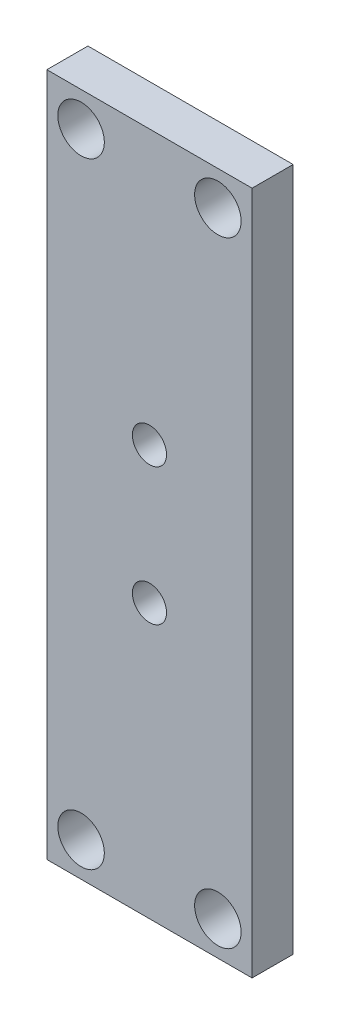
ISO-10303-21;
HEADER;
FILE_DESCRIPTION(('STEP AP214'),'2;1');
FILE_NAME('part.step','',(''),(''),'','','');
FILE_SCHEMA(('AUTOMOTIVE_DESIGN { 1 0 10303 214 1 1 1 1 }'));
ENDSEC;
DATA;
#1=APPLICATION_CONTEXT('core data for automotive mechanical design processes');
#2=APPLICATION_PROTOCOL_DEFINITION('international standard','automotive_design',2000,#1);
#3=PRODUCT_CONTEXT('',#1,'mechanical');
#4=PRODUCT('Part','Part','',(#3));
#5=PRODUCT_RELATED_PRODUCT_CATEGORY('part','',(#4));
#6=PRODUCT_DEFINITION_FORMATION('','',#4);
#7=PRODUCT_DEFINITION_CONTEXT('part definition',#1,'design');
#8=PRODUCT_DEFINITION('design','',#6,#7);
#9=PRODUCT_DEFINITION_SHAPE('','',#8);
#10=(LENGTH_UNIT() NAMED_UNIT(*) SI_UNIT(.MILLI.,.METRE.));
#11=(NAMED_UNIT(*) PLANE_ANGLE_UNIT() SI_UNIT($,.RADIAN.));
#12=(NAMED_UNIT(*) SI_UNIT($,.STERADIAN.) SOLID_ANGLE_UNIT());
#13=UNCERTAINTY_MEASURE_WITH_UNIT(LENGTH_MEASURE(1.E-05),#10,'distance_accuracy_value','');
#14=(GEOMETRIC_REPRESENTATION_CONTEXT(3) GLOBAL_UNCERTAINTY_ASSIGNED_CONTEXT((#13)) GLOBAL_UNIT_ASSIGNED_CONTEXT((#10,
#11,#12)) REPRESENTATION_CONTEXT('',''));
#15=CARTESIAN_POINT('',(0.,0.,0.));
#16=DIRECTION('',(0.,0.,1.));
#17=DIRECTION('',(1.,0.,0.));
#18=AXIS2_PLACEMENT_3D('',#15,#16,#17);
#19=CARTESIAN_POINT('',(7.49999999999999,25.,-3.));
#20=DIRECTION('',(-1.,0.,0.));
#21=DIRECTION('',(0.,-1.,0.));
#22=AXIS2_PLACEMENT_3D('',#19,#20,#21);
#23=PLANE('',#22);
#24=DIRECTION('',(0.,1.,0.));
#25=VECTOR('',#24,1.);
#26=CARTESIAN_POINT('',(7.49999999999999,25.,0.));
#27=LINE('',#26,#25);
#28=CARTESIAN_POINT('',(7.5,-25.,0.));
#29=VERTEX_POINT('',#28);
#30=CARTESIAN_POINT('',(7.49999999999999,25.,0.));
#31=VERTEX_POINT('',#30);
#32=EDGE_CURVE('E105',#29,#31,#27,.T.);
#33=ORIENTED_EDGE('',*,*,#32,.F.);
#34=DIRECTION('',(0.,0.,1.));
#35=VECTOR('',#34,1.);
#36=CARTESIAN_POINT('',(7.5,-25.,-3.));
#37=LINE('',#36,#35);
#38=CARTESIAN_POINT('',(7.5,-25.,-3.));
#39=VERTEX_POINT('',#38);
#40=EDGE_CURVE('E104',#39,#29,#37,.T.);
#41=ORIENTED_EDGE('',*,*,#40,.F.);
#42=DIRECTION('',(0.,1.,0.));
#43=VECTOR('',#42,1.);
#44=CARTESIAN_POINT('',(7.49999999999999,25.,-3.));
#45=LINE('',#44,#43);
#46=CARTESIAN_POINT('',(7.49999999999999,25.,-3.));
#47=VERTEX_POINT('',#46);
#48=EDGE_CURVE('E98',#39,#47,#45,.T.);
#49=ORIENTED_EDGE('',*,*,#48,.T.);
#50=DIRECTION('',(0.,0.,1.));
#51=VECTOR('',#50,1.);
#52=CARTESIAN_POINT('',(7.49999999999999,25.,-3.));
#53=LINE('',#52,#51);
#54=EDGE_CURVE('E11',#47,#31,#53,.T.);
#55=ORIENTED_EDGE('',*,*,#54,.T.);
#56=EDGE_LOOP('',(#33,#41,#49,#55));
#57=FACE_BOUND('',#56,.T.);
#58=ADVANCED_FACE('F41',(#57),#23,.F.);
#59=CARTESIAN_POINT('',(-7.50000000000001,25.,-3.));
#60=DIRECTION('',(0.,-1.,0.));
#61=DIRECTION('',(0.,0.,1.));
#62=AXIS2_PLACEMENT_3D('',#59,#60,#61);
#63=PLANE('',#62);
#64=DIRECTION('',(-1.,0.,0.));
#65=VECTOR('',#64,1.);
#66=CARTESIAN_POINT('',(-7.50000000000001,25.,0.));
#67=LINE('',#66,#65);
#68=CARTESIAN_POINT('',(-7.50000000000001,25.,0.));
#69=VERTEX_POINT('',#68);
#70=EDGE_CURVE('E107',#31,#69,#67,.T.);
#71=ORIENTED_EDGE('',*,*,#70,.F.);
#72=ORIENTED_EDGE('',*,*,#54,.F.);
#73=DIRECTION('',(-1.,0.,0.));
#74=VECTOR('',#73,1.);
#75=CARTESIAN_POINT('',(-7.50000000000001,25.,-3.));
#76=LINE('',#75,#74);
#77=CARTESIAN_POINT('',(-7.50000000000001,25.,-3.));
#78=VERTEX_POINT('',#77);
#79=EDGE_CURVE('E82',#47,#78,#76,.T.);
#80=ORIENTED_EDGE('',*,*,#79,.T.);
#81=DIRECTION('',(0.,0.,1.));
#82=VECTOR('',#81,1.);
#83=CARTESIAN_POINT('',(-7.50000000000001,25.,-3.));
#84=LINE('',#83,#82);
#85=EDGE_CURVE('E49',#78,#69,#84,.T.);
#86=ORIENTED_EDGE('',*,*,#85,.T.);
#87=EDGE_LOOP('',(#71,#72,#80,#86));
#88=FACE_BOUND('',#87,.T.);
#89=ADVANCED_FACE('F96',(#88),#63,.F.);
#90=CARTESIAN_POINT('',(-7.50000000000001,25.,-3.));
#91=DIRECTION('',(1.,0.,0.));
#92=DIRECTION('',(0.,1.,0.));
#93=AXIS2_PLACEMENT_3D('',#90,#91,#92);
#94=PLANE('',#93);
#95=DIRECTION('',(0.,-1.,0.));
#96=VECTOR('',#95,1.);
#97=CARTESIAN_POINT('',(-7.50000000000001,25.,0.));
#98=LINE('',#97,#96);
#99=CARTESIAN_POINT('',(-7.5,-25.,0.));
#100=VERTEX_POINT('',#99);
#101=EDGE_CURVE('E92',#69,#100,#98,.T.);
#102=ORIENTED_EDGE('',*,*,#101,.F.);
#103=ORIENTED_EDGE('',*,*,#85,.F.);
#104=DIRECTION('',(0.,-1.,0.));
#105=VECTOR('',#104,1.);
#106=CARTESIAN_POINT('',(-7.50000000000001,25.,-3.));
#107=LINE('',#106,#105);
#108=CARTESIAN_POINT('',(-7.5,-25.,-3.));
#109=VERTEX_POINT('',#108);
#110=EDGE_CURVE('E85',#78,#109,#107,.T.);
#111=ORIENTED_EDGE('',*,*,#110,.T.);
#112=DIRECTION('',(0.,0.,1.));
#113=VECTOR('',#112,1.);
#114=CARTESIAN_POINT('',(-7.5,-25.,-3.));
#115=LINE('',#114,#113);
#116=EDGE_CURVE('E95',#109,#100,#115,.T.);
#117=ORIENTED_EDGE('',*,*,#116,.T.);
#118=EDGE_LOOP('',(#102,#103,#111,#117));
#119=FACE_BOUND('',#118,.T.);
#120=ADVANCED_FACE('F91',(#119),#94,.F.);
#121=CARTESIAN_POINT('',(-7.5,-25.,-3.));
#122=DIRECTION('',(0.,1.,0.));
#123=DIRECTION('',(0.,0.,-1.));
#124=AXIS2_PLACEMENT_3D('',#121,#122,#123);
#125=PLANE('',#124);
#126=DIRECTION('',(1.,0.,0.));
#127=VECTOR('',#126,1.);
#128=CARTESIAN_POINT('',(-7.5,-25.,0.));
#129=LINE('',#128,#127);
#130=EDGE_CURVE('E71',#100,#29,#129,.T.);
#131=ORIENTED_EDGE('',*,*,#130,.F.);
#132=ORIENTED_EDGE('',*,*,#116,.F.);
#133=DIRECTION('',(1.,0.,0.));
#134=VECTOR('',#133,1.);
#135=CARTESIAN_POINT('',(-7.5,-25.,-3.));
#136=LINE('',#135,#134);
#137=EDGE_CURVE('E57',#109,#39,#136,.T.);
#138=ORIENTED_EDGE('',*,*,#137,.T.);
#139=ORIENTED_EDGE('',*,*,#40,.T.);
#140=EDGE_LOOP('',(#131,#132,#138,#139));
#141=FACE_BOUND('',#140,.T.);
#142=ADVANCED_FACE('F117',(#141),#125,.F.);
#143=CARTESIAN_POINT('',(0.,0.,-3.));
#144=DIRECTION('',(0.,0.,-1.));
#145=DIRECTION('',(1.,0.,0.));
#146=AXIS2_PLACEMENT_3D('',#143,#144,#145);
#147=PLANE('',#146);
#148=CARTESIAN_POINT('',(-5.,22.5,-3.));
#149=DIRECTION('',(0.,0.,1.));
#150=DIRECTION('',(1.,0.,0.));
#151=AXIS2_PLACEMENT_3D('',#148,#149,#150);
#152=CIRCLE('',#151,1.69999999999999);
#153=CARTESIAN_POINT('',(-3.30000000000002,22.5,-3.));
#154=VERTEX_POINT('',#153);
#155=EDGE_CURVE('E231',#154,#154,#152,.T.);
#156=ORIENTED_EDGE('',*,*,#155,.T.);
#157=EDGE_LOOP('',(#156));
#158=FACE_BOUND('',#157,.T.);
#159=CARTESIAN_POINT('',(5.,22.5,-3.));
#160=DIRECTION('',(0.,0.,1.));
#161=DIRECTION('',(1.,0.,0.));
#162=AXIS2_PLACEMENT_3D('',#159,#160,#161);
#163=CIRCLE('',#162,1.69999999999999);
#164=CARTESIAN_POINT('',(6.69999999999999,22.5,-3.));
#165=VERTEX_POINT('',#164);
#166=EDGE_CURVE('E233',#165,#165,#163,.T.);
#167=ORIENTED_EDGE('',*,*,#166,.T.);
#168=EDGE_LOOP('',(#167));
#169=FACE_BOUND('',#168,.T.);
#170=CARTESIAN_POINT('',(-5.,-22.5,-3.));
#171=DIRECTION('',(0.,0.,1.));
#172=DIRECTION('',(1.,0.,0.));
#173=AXIS2_PLACEMENT_3D('',#170,#171,#172);
#174=CIRCLE('',#173,1.69999999999999);
#175=CARTESIAN_POINT('',(-3.30000000000002,-22.5,-3.));
#176=VERTEX_POINT('',#175);
#177=EDGE_CURVE('E241',#176,#176,#174,.T.);
#178=ORIENTED_EDGE('',*,*,#177,.T.);
#179=EDGE_LOOP('',(#178));
#180=FACE_BOUND('',#179,.T.);
#181=CARTESIAN_POINT('',(5.,-22.5,-3.));
#182=DIRECTION('',(0.,0.,1.));
#183=DIRECTION('',(1.,0.,0.));
#184=AXIS2_PLACEMENT_3D('',#181,#182,#183);
#185=CIRCLE('',#184,1.69999999999999);
#186=CARTESIAN_POINT('',(6.69999999999999,-22.5,-3.));
#187=VERTEX_POINT('',#186);
#188=EDGE_CURVE('E247',#187,#187,#185,.T.);
#189=ORIENTED_EDGE('',*,*,#188,.T.);
#190=EDGE_LOOP('',(#189));
#191=FACE_BOUND('',#190,.T.);
#192=CARTESIAN_POINT('',(0.,4.99999999999999,-3.));
#193=DIRECTION('',(0.,0.,1.));
#194=DIRECTION('',(1.,0.,0.));
#195=AXIS2_PLACEMENT_3D('',#192,#193,#194);
#196=CIRCLE('',#195,1.25);
#197=CARTESIAN_POINT('',(1.25,4.99999999999999,-3.));
#198=VERTEX_POINT('',#197);
#199=EDGE_CURVE('E253',#198,#198,#196,.T.);
#200=ORIENTED_EDGE('',*,*,#199,.T.);
#201=EDGE_LOOP('',(#200));
#202=FACE_BOUND('',#201,.T.);
#203=CARTESIAN_POINT('',(0.,-5.00000000000001,-3.));
#204=DIRECTION('',(0.,0.,1.));
#205=DIRECTION('',(1.,0.,0.));
#206=AXIS2_PLACEMENT_3D('',#203,#204,#205);
#207=CIRCLE('',#206,1.25);
#208=CARTESIAN_POINT('',(1.25,-5.00000000000001,-3.));
#209=VERTEX_POINT('',#208);
#210=EDGE_CURVE('E259',#209,#209,#207,.T.);
#211=ORIENTED_EDGE('',*,*,#210,.T.);
#212=EDGE_LOOP('',(#211));
#213=FACE_BOUND('',#212,.T.);
#214=ORIENTED_EDGE('',*,*,#48,.F.);
#215=ORIENTED_EDGE('',*,*,#137,.F.);
#216=ORIENTED_EDGE('',*,*,#110,.F.);
#217=ORIENTED_EDGE('',*,*,#79,.F.);
#218=EDGE_LOOP('',(#214,#215,#216,#217));
#219=FACE_BOUND('',#218,.T.);
#220=ADVANCED_FACE('F87',(#158,#169,#180,#191,#202,#213,#219),#147,.T.);
#221=CARTESIAN_POINT('',(0.,0.,0.));
#222=DIRECTION('',(0.,0.,-1.));
#223=DIRECTION('',(1.,0.,0.));
#224=AXIS2_PLACEMENT_3D('',#221,#222,#223);
#225=PLANE('',#224);
#226=CARTESIAN_POINT('',(-5.,22.5,0.));
#227=DIRECTION('',(0.,0.,1.));
#228=DIRECTION('',(1.,0.,0.));
#229=AXIS2_PLACEMENT_3D('',#226,#227,#228);
#230=CIRCLE('',#229,1.7);
#231=CARTESIAN_POINT('',(-3.30000000000001,22.5,0.));
#232=VERTEX_POINT('',#231);
#233=EDGE_CURVE('E228',#232,#232,#230,.T.);
#234=ORIENTED_EDGE('',*,*,#233,.F.);
#235=EDGE_LOOP('',(#234));
#236=FACE_BOUND('',#235,.T.);
#237=CARTESIAN_POINT('',(5.,22.5,0.));
#238=DIRECTION('',(0.,0.,1.));
#239=DIRECTION('',(1.,0.,0.));
#240=AXIS2_PLACEMENT_3D('',#237,#238,#239);
#241=CIRCLE('',#240,1.7);
#242=CARTESIAN_POINT('',(6.7,22.5,0.));
#243=VERTEX_POINT('',#242);
#244=EDGE_CURVE('E238',#243,#243,#241,.T.);
#245=ORIENTED_EDGE('',*,*,#244,.F.);
#246=EDGE_LOOP('',(#245));
#247=FACE_BOUND('',#246,.T.);
#248=CARTESIAN_POINT('',(-5.,-22.5,0.));
#249=DIRECTION('',(0.,0.,1.));
#250=DIRECTION('',(1.,0.,0.));
#251=AXIS2_PLACEMENT_3D('',#248,#249,#250);
#252=CIRCLE('',#251,1.7);
#253=CARTESIAN_POINT('',(-3.30000000000001,-22.5,0.));
#254=VERTEX_POINT('',#253);
#255=EDGE_CURVE('E244',#254,#254,#252,.T.);
#256=ORIENTED_EDGE('',*,*,#255,.F.);
#257=EDGE_LOOP('',(#256));
#258=FACE_BOUND('',#257,.T.);
#259=CARTESIAN_POINT('',(5.,-22.5,0.));
#260=DIRECTION('',(0.,0.,1.));
#261=DIRECTION('',(1.,0.,0.));
#262=AXIS2_PLACEMENT_3D('',#259,#260,#261);
#263=CIRCLE('',#262,1.7);
#264=CARTESIAN_POINT('',(6.7,-22.5,0.));
#265=VERTEX_POINT('',#264);
#266=EDGE_CURVE('E250',#265,#265,#263,.T.);
#267=ORIENTED_EDGE('',*,*,#266,.F.);
#268=EDGE_LOOP('',(#267));
#269=FACE_BOUND('',#268,.T.);
#270=CARTESIAN_POINT('',(0.,4.99999999999999,0.));
#271=DIRECTION('',(0.,0.,1.));
#272=DIRECTION('',(1.,0.,0.));
#273=AXIS2_PLACEMENT_3D('',#270,#271,#272);
#274=CIRCLE('',#273,1.25);
#275=CARTESIAN_POINT('',(1.25,4.99999999999999,0.));
#276=VERTEX_POINT('',#275);
#277=EDGE_CURVE('E256',#276,#276,#274,.T.);
#278=ORIENTED_EDGE('',*,*,#277,.F.);
#279=EDGE_LOOP('',(#278));
#280=FACE_BOUND('',#279,.T.);
#281=CARTESIAN_POINT('',(0.,-5.00000000000001,0.));
#282=DIRECTION('',(0.,0.,1.));
#283=DIRECTION('',(1.,0.,0.));
#284=AXIS2_PLACEMENT_3D('',#281,#282,#283);
#285=CIRCLE('',#284,1.25);
#286=CARTESIAN_POINT('',(1.25,-5.00000000000001,0.));
#287=VERTEX_POINT('',#286);
#288=EDGE_CURVE('E108',#287,#287,#285,.T.);
#289=ORIENTED_EDGE('',*,*,#288,.F.);
#290=EDGE_LOOP('',(#289));
#291=FACE_BOUND('',#290,.T.);
#292=ORIENTED_EDGE('',*,*,#32,.T.);
#293=ORIENTED_EDGE('',*,*,#70,.T.);
#294=ORIENTED_EDGE('',*,*,#101,.T.);
#295=ORIENTED_EDGE('',*,*,#130,.T.);
#296=EDGE_LOOP('',(#292,#293,#294,#295));
#297=FACE_BOUND('',#296,.T.);
#298=ADVANCED_FACE('F113',(#236,#247,#258,#269,#280,#291,#297),#225,.F.);
#299=CARTESIAN_POINT('',(0.,-5.00000000000001,-3.));
#300=DIRECTION('',(0.,0.,-1.));
#301=DIRECTION('',(1.,0.,0.));
#302=AXIS2_PLACEMENT_3D('',#299,#300,#301);
#303=CYLINDRICAL_SURFACE('',#302,1.25);
#304=ORIENTED_EDGE('',*,*,#288,.T.);
#305=EDGE_LOOP('',(#304));
#306=FACE_BOUND('',#305,.T.);
#307=ORIENTED_EDGE('',*,*,#210,.F.);
#308=EDGE_LOOP('',(#307));
#309=FACE_BOUND('',#308,.T.);
#310=ADVANCED_FACE('F158',(#306,#309),#303,.F.);
#311=CARTESIAN_POINT('',(0.,4.99999999999999,-3.));
#312=DIRECTION('',(0.,0.,-1.));
#313=DIRECTION('',(1.,0.,0.));
#314=AXIS2_PLACEMENT_3D('',#311,#312,#313);
#315=CYLINDRICAL_SURFACE('',#314,1.25);
#316=ORIENTED_EDGE('',*,*,#277,.T.);
#317=EDGE_LOOP('',(#316));
#318=FACE_BOUND('',#317,.T.);
#319=ORIENTED_EDGE('',*,*,#199,.F.);
#320=EDGE_LOOP('',(#319));
#321=FACE_BOUND('',#320,.T.);
#322=ADVANCED_FACE('F168',(#318,#321),#315,.F.);
#323=CARTESIAN_POINT('',(5.,-22.5,-3.));
#324=DIRECTION('',(0.,0.,-1.));
#325=DIRECTION('',(1.,0.,0.));
#326=AXIS2_PLACEMENT_3D('',#323,#324,#325);
#327=CYLINDRICAL_SURFACE('',#326,1.69999999999999);
#328=ORIENTED_EDGE('',*,*,#266,.T.);
#329=EDGE_LOOP('',(#328));
#330=FACE_BOUND('',#329,.T.);
#331=ORIENTED_EDGE('',*,*,#188,.F.);
#332=EDGE_LOOP('',(#331));
#333=FACE_BOUND('',#332,.T.);
#334=ADVANCED_FACE('F180',(#330,#333),#327,.F.);
#335=CARTESIAN_POINT('',(-5.,-22.5,-3.));
#336=DIRECTION('',(0.,0.,-1.));
#337=DIRECTION('',(1.,0.,0.));
#338=AXIS2_PLACEMENT_3D('',#335,#336,#337);
#339=CYLINDRICAL_SURFACE('',#338,1.69999999999999);
#340=ORIENTED_EDGE('',*,*,#255,.T.);
#341=EDGE_LOOP('',(#340));
#342=FACE_BOUND('',#341,.T.);
#343=ORIENTED_EDGE('',*,*,#177,.F.);
#344=EDGE_LOOP('',(#343));
#345=FACE_BOUND('',#344,.T.);
#346=ADVANCED_FACE('F191',(#342,#345),#339,.F.);
#347=CARTESIAN_POINT('',(5.,22.5,-3.));
#348=DIRECTION('',(0.,0.,-1.));
#349=DIRECTION('',(1.,0.,0.));
#350=AXIS2_PLACEMENT_3D('',#347,#348,#349);
#351=CYLINDRICAL_SURFACE('',#350,1.69999999999999);
#352=ORIENTED_EDGE('',*,*,#244,.T.);
#353=EDGE_LOOP('',(#352));
#354=FACE_BOUND('',#353,.T.);
#355=ORIENTED_EDGE('',*,*,#166,.F.);
#356=EDGE_LOOP('',(#355));
#357=FACE_BOUND('',#356,.T.);
#358=ADVANCED_FACE('F201',(#354,#357),#351,.F.);
#359=CARTESIAN_POINT('',(-5.,22.5,-3.));
#360=DIRECTION('',(0.,0.,-1.));
#361=DIRECTION('',(1.,0.,0.));
#362=AXIS2_PLACEMENT_3D('',#359,#360,#361);
#363=CYLINDRICAL_SURFACE('',#362,1.69999999999999);
#364=ORIENTED_EDGE('',*,*,#233,.T.);
#365=EDGE_LOOP('',(#364));
#366=FACE_BOUND('',#365,.T.);
#367=ORIENTED_EDGE('',*,*,#155,.F.);
#368=EDGE_LOOP('',(#367));
#369=FACE_BOUND('',#368,.T.);
#370=ADVANCED_FACE('F211',(#366,#369),#363,.F.);
#371=CLOSED_SHELL('',(#58,#89,#120,#142,#220,#298,#310,#322,#334,#346,#358,#370));
#372=MANIFOLD_SOLID_BREP('B2',#371);
#373=ADVANCED_BREP_SHAPE_REPRESENTATION('',(#18,#372),#14);
#374=SHAPE_DEFINITION_REPRESENTATION(#9,#373);
ENDSEC;
END-ISO-10303-21;
